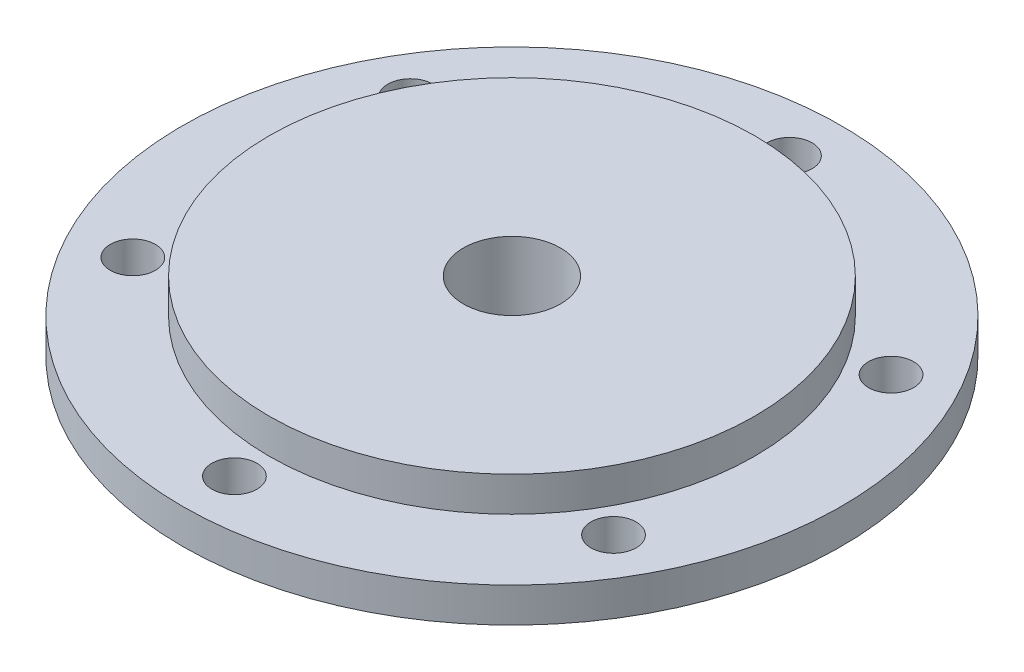
ISO-10303-21;
HEADER;
FILE_DESCRIPTION(('STEP AP214'),'2;1');
FILE_NAME('part.step','',(''),(''),'','','');
FILE_SCHEMA(('AUTOMOTIVE_DESIGN { 1 0 10303 214 1 1 1 1 }'));
ENDSEC;
DATA;
#1=APPLICATION_CONTEXT('core data for automotive mechanical design processes');
#2=APPLICATION_PROTOCOL_DEFINITION('international standard','automotive_design',2000,#1);
#3=PRODUCT_CONTEXT('',#1,'mechanical');
#4=PRODUCT('Part','Part','',(#3));
#5=PRODUCT_RELATED_PRODUCT_CATEGORY('part','',(#4));
#6=PRODUCT_DEFINITION_FORMATION('','',#4);
#7=PRODUCT_DEFINITION_CONTEXT('part definition',#1,'design');
#8=PRODUCT_DEFINITION('design','',#6,#7);
#9=PRODUCT_DEFINITION_SHAPE('','',#8);
#10=(LENGTH_UNIT() NAMED_UNIT(*) SI_UNIT(.MILLI.,.METRE.));
#11=(NAMED_UNIT(*) PLANE_ANGLE_UNIT() SI_UNIT($,.RADIAN.));
#12=(NAMED_UNIT(*) SI_UNIT($,.STERADIAN.) SOLID_ANGLE_UNIT());
#13=UNCERTAINTY_MEASURE_WITH_UNIT(LENGTH_MEASURE(1.E-05),#10,'distance_accuracy_value','');
#14=(GEOMETRIC_REPRESENTATION_CONTEXT(3) GLOBAL_UNCERTAINTY_ASSIGNED_CONTEXT((#13)) GLOBAL_UNIT_ASSIGNED_CONTEXT((#10,
#11,#12)) REPRESENTATION_CONTEXT('',''));
#15=CARTESIAN_POINT('',(0.,0.,0.));
#16=DIRECTION('',(0.,0.,1.));
#17=DIRECTION('',(1.,0.,0.));
#18=AXIS2_PLACEMENT_3D('',#15,#16,#17);
#19=CARTESIAN_POINT('',(0.,2.5,0.));
#20=DIRECTION('',(0.,1.,0.));
#21=DIRECTION('',(0.,0.,1.));
#22=AXIS2_PLACEMENT_3D('',#19,#20,#21);
#23=PLANE('',#22);
#24=CARTESIAN_POINT('',(0.,2.5,0.));
#25=DIRECTION('',(0.,1.,0.));
#26=DIRECTION('',(0.,0.,1.));
#27=AXIS2_PLACEMENT_3D('',#24,#25,#26);
#28=CIRCLE('',#27,35.);
#29=CARTESIAN_POINT('',(0.,2.5,35.));
#30=VERTEX_POINT('',#29);
#31=EDGE_CURVE('E42',#30,#30,#28,.T.);
#32=ORIENTED_EDGE('',*,*,#31,.F.);
#33=EDGE_LOOP('',(#32));
#34=FACE_BOUND('',#33,.T.);
#35=CARTESIAN_POINT('',(-34.6410161513741,2.5,20.000000000002));
#36=DIRECTION('',(0.,1.,0.));
#37=DIRECTION('',(0.,0.,1.));
#38=AXIS2_PLACEMENT_3D('',#35,#36,#37);
#39=CIRCLE('',#38,3.25000000000418);
#40=CARTESIAN_POINT('',(-34.6410161513741,2.5,23.2500000000062));
#41=VERTEX_POINT('',#40);
#42=EDGE_CURVE('E76',#41,#41,#39,.T.);
#43=ORIENTED_EDGE('',*,*,#42,.F.);
#44=EDGE_LOOP('',(#43));
#45=FACE_BOUND('',#44,.T.);
#46=CARTESIAN_POINT('',(34.6410161513809,2.5,19.999999999998));
#47=DIRECTION('',(0.,1.,0.));
#48=DIRECTION('',(0.,0.,1.));
#49=AXIS2_PLACEMENT_3D('',#46,#47,#48);
#50=CIRCLE('',#49,3.25000000000286);
#51=CARTESIAN_POINT('',(34.6410161513809,2.5,23.2500000000009));
#52=VERTEX_POINT('',#51);
#53=EDGE_CURVE('E64',#52,#52,#50,.T.);
#54=ORIENTED_EDGE('',*,*,#53,.F.);
#55=EDGE_LOOP('',(#54));
#56=FACE_BOUND('',#55,.T.);
#57=CARTESIAN_POINT('',(0.,2.5,-40.));
#58=DIRECTION('',(0.,1.,0.));
#59=DIRECTION('',(0.,0.,1.));
#60=AXIS2_PLACEMENT_3D('',#57,#58,#59);
#61=CIRCLE('',#60,3.25);
#62=CARTESIAN_POINT('',(0.,2.5,-36.75));
#63=VERTEX_POINT('',#62);
#64=EDGE_CURVE('E52',#63,#63,#61,.T.);
#65=ORIENTED_EDGE('',*,*,#64,.F.);
#66=EDGE_LOOP('',(#65));
#67=FACE_BOUND('',#66,.T.);
#68=CARTESIAN_POINT('',(0.,2.5,0.));
#69=DIRECTION('',(0.,1.,0.));
#70=DIRECTION('',(0.,0.,1.));
#71=AXIS2_PLACEMENT_3D('',#68,#69,#70);
#72=CIRCLE('',#71,47.5);
#73=CARTESIAN_POINT('',(0.,2.5,47.5));
#74=VERTEX_POINT('',#73);
#75=EDGE_CURVE('E46',#74,#74,#72,.T.);
#76=ORIENTED_EDGE('',*,*,#75,.T.);
#77=EDGE_LOOP('',(#76));
#78=FACE_BOUND('',#77,.T.);
#79=CARTESIAN_POINT('',(34.6410161513787,2.5,-20.000000000002));
#80=DIRECTION('',(0.,1.,0.));
#81=DIRECTION('',(0.,0.,1.));
#82=AXIS2_PLACEMENT_3D('',#79,#80,#81);
#83=CIRCLE('',#82,3.25000000000062);
#84=CARTESIAN_POINT('',(34.6410161513787,2.5,-16.7500000000014));
#85=VERTEX_POINT('',#84);
#86=EDGE_CURVE('E58',#85,#85,#83,.T.);
#87=ORIENTED_EDGE('',*,*,#86,.F.);
#88=EDGE_LOOP('',(#87));
#89=FACE_BOUND('',#88,.T.);
#90=CARTESIAN_POINT('',(4.53277774727487E-12,2.5,40.));
#91=DIRECTION('',(0.,1.,0.));
#92=DIRECTION('',(0.,0.,1.));
#93=AXIS2_PLACEMENT_3D('',#90,#91,#92);
#94=CIRCLE('',#93,3.2500000000046);
#95=CARTESIAN_POINT('',(4.53277774727487E-12,2.5,43.2500000000046));
#96=VERTEX_POINT('',#95);
#97=EDGE_CURVE('E70',#96,#96,#94,.T.);
#98=ORIENTED_EDGE('',*,*,#97,.F.);
#99=EDGE_LOOP('',(#98));
#100=FACE_BOUND('',#99,.T.);
#101=CARTESIAN_POINT('',(-34.6410161513764,2.5,-19.999999999998));
#102=DIRECTION('',(0.,1.,0.));
#103=DIRECTION('',(0.,0.,1.));
#104=AXIS2_PLACEMENT_3D('',#101,#102,#103);
#105=CIRCLE('',#104,3.25000000000214);
#106=CARTESIAN_POINT('',(-34.6410161513764,2.5,-16.7499999999959));
#107=VERTEX_POINT('',#106);
#108=EDGE_CURVE('E82',#107,#107,#105,.T.);
#109=ORIENTED_EDGE('',*,*,#108,.F.);
#110=EDGE_LOOP('',(#109));
#111=FACE_BOUND('',#110,.T.);
#112=ADVANCED_FACE('F31',(#34,#45,#56,#67,#78,#89,#100,#111),#23,.T.);
#113=CARTESIAN_POINT('',(0.,-2.5,0.));
#114=DIRECTION('',(0.,1.,0.));
#115=DIRECTION('',(0.,0.,1.));
#116=AXIS2_PLACEMENT_3D('',#113,#114,#115);
#117=PLANE('',#116);
#118=CARTESIAN_POINT('',(0.,-2.5,0.));
#119=DIRECTION('',(0.,1.,0.));
#120=DIRECTION('',(0.,0.,1.));
#121=AXIS2_PLACEMENT_3D('',#118,#119,#120);
#122=CIRCLE('',#121,19.);
#123=CARTESIAN_POINT('',(0.,-2.5,19.));
#124=VERTEX_POINT('',#123);
#125=EDGE_CURVE('E10',#124,#124,#122,.T.);
#126=ORIENTED_EDGE('',*,*,#125,.T.);
#127=EDGE_LOOP('',(#126));
#128=FACE_BOUND('',#127,.T.);
#129=CARTESIAN_POINT('',(0.,-2.5,0.));
#130=DIRECTION('',(0.,1.,0.));
#131=DIRECTION('',(0.,0.,1.));
#132=AXIS2_PLACEMENT_3D('',#129,#130,#131);
#133=CIRCLE('',#132,47.5);
#134=CARTESIAN_POINT('',(0.,-2.5,47.5));
#135=VERTEX_POINT('',#134);
#136=EDGE_CURVE('E49',#135,#135,#133,.T.);
#137=ORIENTED_EDGE('',*,*,#136,.F.);
#138=EDGE_LOOP('',(#137));
#139=FACE_BOUND('',#138,.T.);
#140=CARTESIAN_POINT('',(0.,-2.5,-40.));
#141=DIRECTION('',(0.,1.,0.));
#142=DIRECTION('',(0.,0.,1.));
#143=AXIS2_PLACEMENT_3D('',#140,#141,#142);
#144=CIRCLE('',#143,3.25);
#145=CARTESIAN_POINT('',(0.,-2.5,-36.75));
#146=VERTEX_POINT('',#145);
#147=EDGE_CURVE('E55',#146,#146,#144,.T.);
#148=ORIENTED_EDGE('',*,*,#147,.T.);
#149=EDGE_LOOP('',(#148));
#150=FACE_BOUND('',#149,.T.);
#151=CARTESIAN_POINT('',(34.6410161513787,-2.5,-20.000000000002));
#152=DIRECTION('',(0.,1.,0.));
#153=DIRECTION('',(0.,0.,1.));
#154=AXIS2_PLACEMENT_3D('',#151,#152,#153);
#155=CIRCLE('',#154,3.25000000000062);
#156=CARTESIAN_POINT('',(34.6410161513787,-2.5,-16.7500000000014));
#157=VERTEX_POINT('',#156);
#158=EDGE_CURVE('E61',#157,#157,#155,.T.);
#159=ORIENTED_EDGE('',*,*,#158,.T.);
#160=EDGE_LOOP('',(#159));
#161=FACE_BOUND('',#160,.T.);
#162=CARTESIAN_POINT('',(34.6410161513809,-2.5,19.999999999998));
#163=DIRECTION('',(0.,1.,0.));
#164=DIRECTION('',(0.,0.,1.));
#165=AXIS2_PLACEMENT_3D('',#162,#163,#164);
#166=CIRCLE('',#165,3.25000000000286);
#167=CARTESIAN_POINT('',(34.6410161513809,-2.5,23.2500000000009));
#168=VERTEX_POINT('',#167);
#169=EDGE_CURVE('E67',#168,#168,#166,.T.);
#170=ORIENTED_EDGE('',*,*,#169,.T.);
#171=EDGE_LOOP('',(#170));
#172=FACE_BOUND('',#171,.T.);
#173=CARTESIAN_POINT('',(4.53277774727487E-12,-2.5,40.));
#174=DIRECTION('',(0.,1.,0.));
#175=DIRECTION('',(0.,0.,1.));
#176=AXIS2_PLACEMENT_3D('',#173,#174,#175);
#177=CIRCLE('',#176,3.2500000000046);
#178=CARTESIAN_POINT('',(4.53277774727487E-12,-2.5,43.2500000000046));
#179=VERTEX_POINT('',#178);
#180=EDGE_CURVE('E73',#179,#179,#177,.T.);
#181=ORIENTED_EDGE('',*,*,#180,.T.);
#182=EDGE_LOOP('',(#181));
#183=FACE_BOUND('',#182,.T.);
#184=CARTESIAN_POINT('',(-34.6410161513741,-2.5,20.000000000002));
#185=DIRECTION('',(0.,1.,0.));
#186=DIRECTION('',(0.,0.,1.));
#187=AXIS2_PLACEMENT_3D('',#184,#185,#186);
#188=CIRCLE('',#187,3.25000000000418);
#189=CARTESIAN_POINT('',(-34.6410161513741,-2.5,23.2500000000062));
#190=VERTEX_POINT('',#189);
#191=EDGE_CURVE('E79',#190,#190,#188,.T.);
#192=ORIENTED_EDGE('',*,*,#191,.T.);
#193=EDGE_LOOP('',(#192));
#194=FACE_BOUND('',#193,.T.);
#195=CARTESIAN_POINT('',(-34.6410161513764,-2.5,-19.999999999998));
#196=DIRECTION('',(0.,1.,0.));
#197=DIRECTION('',(0.,0.,1.));
#198=AXIS2_PLACEMENT_3D('',#195,#196,#197);
#199=CIRCLE('',#198,3.25000000000214);
#200=CARTESIAN_POINT('',(-34.6410161513764,-2.5,-16.7499999999959));
#201=VERTEX_POINT('',#200);
#202=EDGE_CURVE('E85',#201,#201,#199,.T.);
#203=ORIENTED_EDGE('',*,*,#202,.T.);
#204=EDGE_LOOP('',(#203));
#205=FACE_BOUND('',#204,.T.);
#206=ADVANCED_FACE('F129',(#128,#139,#150,#161,#172,#183,#194,#205),#117,.F.);
#207=CARTESIAN_POINT('',(0.,2.5,0.));
#208=DIRECTION('',(0.,-1.,0.));
#209=DIRECTION('',(0.,0.,-1.));
#210=AXIS2_PLACEMENT_3D('',#207,#208,#209);
#211=CYLINDRICAL_SURFACE('',#210,47.5);
#212=ORIENTED_EDGE('',*,*,#75,.F.);
#213=EDGE_LOOP('',(#212));
#214=FACE_BOUND('',#213,.T.);
#215=ORIENTED_EDGE('',*,*,#136,.T.);
#216=EDGE_LOOP('',(#215));
#217=FACE_BOUND('',#216,.T.);
#218=ADVANCED_FACE('F135',(#214,#217),#211,.T.);
#219=CARTESIAN_POINT('',(0.,2.5,-40.));
#220=DIRECTION('',(0.,-1.,0.));
#221=DIRECTION('',(0.,0.,-1.));
#222=AXIS2_PLACEMENT_3D('',#219,#220,#221);
#223=CYLINDRICAL_SURFACE('',#222,3.25);
#224=ORIENTED_EDGE('',*,*,#64,.T.);
#225=EDGE_LOOP('',(#224));
#226=FACE_BOUND('',#225,.T.);
#227=ORIENTED_EDGE('',*,*,#147,.F.);
#228=EDGE_LOOP('',(#227));
#229=FACE_BOUND('',#228,.T.);
#230=ADVANCED_FACE('F140',(#226,#229),#223,.F.);
#231=CARTESIAN_POINT('',(34.6410161513787,2.5,-20.000000000002));
#232=DIRECTION('',(0.,-1.,0.));
#233=DIRECTION('',(0.,0.,-1.));
#234=AXIS2_PLACEMENT_3D('',#231,#232,#233);
#235=CYLINDRICAL_SURFACE('',#234,3.25000000000062);
#236=ORIENTED_EDGE('',*,*,#86,.T.);
#237=EDGE_LOOP('',(#236));
#238=FACE_BOUND('',#237,.T.);
#239=ORIENTED_EDGE('',*,*,#158,.F.);
#240=EDGE_LOOP('',(#239));
#241=FACE_BOUND('',#240,.T.);
#242=ADVANCED_FACE('F147',(#238,#241),#235,.F.);
#243=CARTESIAN_POINT('',(34.6410161513809,2.5,19.999999999998));
#244=DIRECTION('',(0.,-1.,0.));
#245=DIRECTION('',(0.,0.,-1.));
#246=AXIS2_PLACEMENT_3D('',#243,#244,#245);
#247=CYLINDRICAL_SURFACE('',#246,3.25000000000286);
#248=ORIENTED_EDGE('',*,*,#53,.T.);
#249=EDGE_LOOP('',(#248));
#250=FACE_BOUND('',#249,.T.);
#251=ORIENTED_EDGE('',*,*,#169,.F.);
#252=EDGE_LOOP('',(#251));
#253=FACE_BOUND('',#252,.T.);
#254=ADVANCED_FACE('F181',(#250,#253),#247,.F.);
#255=CARTESIAN_POINT('',(4.53277774727487E-12,2.5,40.));
#256=DIRECTION('',(0.,-1.,0.));
#257=DIRECTION('',(0.,0.,-1.));
#258=AXIS2_PLACEMENT_3D('',#255,#256,#257);
#259=CYLINDRICAL_SURFACE('',#258,3.2500000000046);
#260=ORIENTED_EDGE('',*,*,#97,.T.);
#261=EDGE_LOOP('',(#260));
#262=FACE_BOUND('',#261,.T.);
#263=ORIENTED_EDGE('',*,*,#180,.F.);
#264=EDGE_LOOP('',(#263));
#265=FACE_BOUND('',#264,.T.);
#266=ADVANCED_FACE('F175',(#262,#265),#259,.F.);
#267=CARTESIAN_POINT('',(-34.6410161513741,2.5,20.000000000002));
#268=DIRECTION('',(0.,-1.,0.));
#269=DIRECTION('',(0.,0.,-1.));
#270=AXIS2_PLACEMENT_3D('',#267,#268,#269);
#271=CYLINDRICAL_SURFACE('',#270,3.25000000000418);
#272=ORIENTED_EDGE('',*,*,#42,.T.);
#273=EDGE_LOOP('',(#272));
#274=FACE_BOUND('',#273,.T.);
#275=ORIENTED_EDGE('',*,*,#191,.F.);
#276=EDGE_LOOP('',(#275));
#277=FACE_BOUND('',#276,.T.);
#278=ADVANCED_FACE('F168',(#274,#277),#271,.F.);
#279=CARTESIAN_POINT('',(-34.6410161513764,2.5,-19.999999999998));
#280=DIRECTION('',(0.,-1.,0.));
#281=DIRECTION('',(0.,0.,-1.));
#282=AXIS2_PLACEMENT_3D('',#279,#280,#281);
#283=CYLINDRICAL_SURFACE('',#282,3.25000000000214);
#284=ORIENTED_EDGE('',*,*,#108,.T.);
#285=EDGE_LOOP('',(#284));
#286=FACE_BOUND('',#285,.T.);
#287=ORIENTED_EDGE('',*,*,#202,.F.);
#288=EDGE_LOOP('',(#287));
#289=FACE_BOUND('',#288,.T.);
#290=ADVANCED_FACE('F166',(#286,#289),#283,.F.);
#291=CARTESIAN_POINT('',(0.,7.5,0.));
#292=DIRECTION('',(0.,1.,0.));
#293=DIRECTION('',(0.,0.,1.));
#294=AXIS2_PLACEMENT_3D('',#291,#292,#293);
#295=PLANE('',#294);
#296=CARTESIAN_POINT('',(0.,7.5,0.));
#297=DIRECTION('',(0.,-1.,0.));
#298=DIRECTION('',(0.,0.,-1.));
#299=AXIS2_PLACEMENT_3D('',#296,#297,#298);
#300=CIRCLE('',#299,7.);
#301=CARTESIAN_POINT('',(0.,7.5,-7.));
#302=VERTEX_POINT('',#301);
#303=EDGE_CURVE('E99',#302,#302,#300,.T.);
#304=ORIENTED_EDGE('',*,*,#303,.T.);
#305=EDGE_LOOP('',(#304));
#306=FACE_BOUND('',#305,.T.);
#307=CARTESIAN_POINT('',(0.,7.5,0.));
#308=DIRECTION('',(0.,1.,0.));
#309=DIRECTION('',(0.,0.,1.));
#310=AXIS2_PLACEMENT_3D('',#307,#308,#309);
#311=CIRCLE('',#310,35.);
#312=CARTESIAN_POINT('',(0.,7.5,35.));
#313=VERTEX_POINT('',#312);
#314=EDGE_CURVE('E88',#313,#313,#311,.T.);
#315=ORIENTED_EDGE('',*,*,#314,.T.);
#316=EDGE_LOOP('',(#315));
#317=FACE_BOUND('',#316,.T.);
#318=ADVANCED_FACE('F103',(#306,#317),#295,.T.);
#319=CARTESIAN_POINT('',(0.,7.5,0.));
#320=DIRECTION('',(0.,-1.,0.));
#321=DIRECTION('',(0.,0.,-1.));
#322=AXIS2_PLACEMENT_3D('',#319,#320,#321);
#323=CYLINDRICAL_SURFACE('',#322,35.);
#324=ORIENTED_EDGE('',*,*,#314,.F.);
#325=EDGE_LOOP('',(#324));
#326=FACE_BOUND('',#325,.T.);
#327=ORIENTED_EDGE('',*,*,#31,.T.);
#328=EDGE_LOOP('',(#327));
#329=FACE_BOUND('',#328,.T.);
#330=ADVANCED_FACE('F120',(#326,#329),#323,.T.);
#331=CARTESIAN_POINT('',(0.,-20.5,0.));
#332=DIRECTION('',(0.,1.,0.));
#333=DIRECTION('',(0.,0.,1.));
#334=AXIS2_PLACEMENT_3D('',#331,#332,#333);
#335=CYLINDRICAL_SURFACE('',#334,14.);
#336=CARTESIAN_POINT('',(0.,-7.5,0.));
#337=DIRECTION('',(0.,1.,0.));
#338=DIRECTION('',(0.,0.,1.));
#339=AXIS2_PLACEMENT_3D('',#336,#337,#338);
#340=CIRCLE('',#339,14.);
#341=CARTESIAN_POINT('',(0.,-7.5,14.));
#342=VERTEX_POINT('',#341);
#343=EDGE_CURVE('E38',#342,#342,#340,.F.);
#344=ORIENTED_EDGE('',*,*,#343,.T.);
#345=EDGE_LOOP('',(#344));
#346=FACE_BOUND('',#345,.T.);
#347=CARTESIAN_POINT('',(0.,-20.5,0.));
#348=DIRECTION('',(0.,-1.,0.));
#349=DIRECTION('',(0.,0.,-1.));
#350=AXIS2_PLACEMENT_3D('',#347,#348,#349);
#351=CIRCLE('',#350,14.);
#352=CARTESIAN_POINT('',(0.,-20.5,-14.));
#353=VERTEX_POINT('',#352);
#354=EDGE_CURVE('E93',#353,#353,#351,.T.);
#355=ORIENTED_EDGE('',*,*,#354,.F.);
#356=EDGE_LOOP('',(#355));
#357=FACE_BOUND('',#356,.T.);
#358=ADVANCED_FACE('F115',(#346,#357),#335,.T.);
#359=CARTESIAN_POINT('',(0.,-20.5,0.));
#360=DIRECTION('',(0.,-1.,0.));
#361=DIRECTION('',(0.,0.,-1.));
#362=AXIS2_PLACEMENT_3D('',#359,#360,#361);
#363=PLANE('',#362);
#364=CARTESIAN_POINT('',(0.,-20.5,0.));
#365=DIRECTION('',(0.,-1.,0.));
#366=DIRECTION('',(0.,0.,-1.));
#367=AXIS2_PLACEMENT_3D('',#364,#365,#366);
#368=CIRCLE('',#367,7.);
#369=CARTESIAN_POINT('',(0.,-20.5,-7.));
#370=VERTEX_POINT('',#369);
#371=EDGE_CURVE('E96',#370,#370,#368,.T.);
#372=ORIENTED_EDGE('',*,*,#371,.F.);
#373=EDGE_LOOP('',(#372));
#374=FACE_BOUND('',#373,.T.);
#375=ORIENTED_EDGE('',*,*,#354,.T.);
#376=EDGE_LOOP('',(#375));
#377=FACE_BOUND('',#376,.T.);
#378=ADVANCED_FACE('F109',(#374,#377),#363,.T.);
#379=CARTESIAN_POINT('',(0.,-2.5,0.));
#380=DIRECTION('',(0.,1.,0.));
#381=DIRECTION('',(0.,0.,1.));
#382=AXIS2_PLACEMENT_3D('',#379,#380,#381);
#383=CYLINDRICAL_SURFACE('',#382,7.);
#384=ORIENTED_EDGE('',*,*,#303,.F.);
#385=EDGE_LOOP('',(#384));
#386=FACE_BOUND('',#385,.T.);
#387=ORIENTED_EDGE('',*,*,#371,.T.);
#388=EDGE_LOOP('',(#387));
#389=FACE_BOUND('',#388,.T.);
#390=ADVANCED_FACE('F106',(#386,#389),#383,.F.);
#391=CARTESIAN_POINT('',(0.,-7.5,0.));
#392=DIRECTION('',(0.,1.,0.));
#393=DIRECTION('',(0.,0.,1.));
#394=AXIS2_PLACEMENT_3D('',#391,#392,#393);
#395=TOROIDAL_SURFACE('',#394,19.,5.);
#396=ORIENTED_EDGE('',*,*,#125,.F.);
#397=EDGE_LOOP('',(#396));
#398=FACE_BOUND('',#397,.T.);
#399=ORIENTED_EDGE('',*,*,#343,.F.);
#400=EDGE_LOOP('',(#399));
#401=FACE_BOUND('',#400,.T.);
#402=ADVANCED_FACE('F33',(#398,#401),#395,.F.);
#403=CLOSED_SHELL('',(#112,#206,#218,#230,#242,#254,#266,#278,#290,#318,#330,#358,#378,#390,#402));
#404=MANIFOLD_SOLID_BREP('B2',#403);
#405=ADVANCED_BREP_SHAPE_REPRESENTATION('',(#18,#404),#14);
#406=SHAPE_DEFINITION_REPRESENTATION(#9,#405);
ENDSEC;
END-ISO-10303-21;
